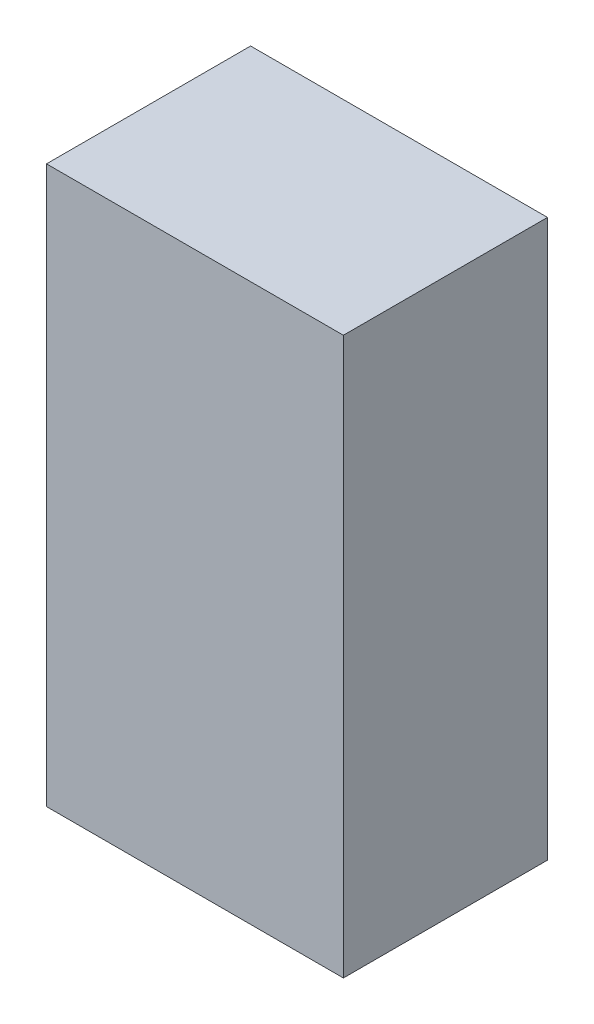
ISO-10303-21;
HEADER;
FILE_DESCRIPTION(('STEP AP214'),'2;1');
FILE_NAME('part.step','',(''),(''),'','','');
FILE_SCHEMA(('AUTOMOTIVE_DESIGN { 1 0 10303 214 1 1 1 1 }'));
ENDSEC;
DATA;
#1=APPLICATION_CONTEXT('core data for automotive mechanical design processes');
#2=APPLICATION_PROTOCOL_DEFINITION('international standard','automotive_design',2000,#1);
#3=PRODUCT_CONTEXT('',#1,'mechanical');
#4=PRODUCT('Part','Part','',(#3));
#5=PRODUCT_RELATED_PRODUCT_CATEGORY('part','',(#4));
#6=PRODUCT_DEFINITION_FORMATION('','',#4);
#7=PRODUCT_DEFINITION_CONTEXT('part definition',#1,'design');
#8=PRODUCT_DEFINITION('design','',#6,#7);
#9=PRODUCT_DEFINITION_SHAPE('','',#8);
#10=(LENGTH_UNIT() NAMED_UNIT(*) SI_UNIT(.MILLI.,.METRE.));
#11=(NAMED_UNIT(*) PLANE_ANGLE_UNIT() SI_UNIT($,.RADIAN.));
#12=(NAMED_UNIT(*) SI_UNIT($,.STERADIAN.) SOLID_ANGLE_UNIT());
#13=UNCERTAINTY_MEASURE_WITH_UNIT(LENGTH_MEASURE(1.E-05),#10,'distance_accuracy_value','');
#14=(GEOMETRIC_REPRESENTATION_CONTEXT(3) GLOBAL_UNCERTAINTY_ASSIGNED_CONTEXT((#13)) GLOBAL_UNIT_ASSIGNED_CONTEXT((#10,
#11,#12)) REPRESENTATION_CONTEXT('',''));
#15=CARTESIAN_POINT('',(0.,0.,0.));
#16=DIRECTION('',(0.,0.,1.));
#17=DIRECTION('',(1.,0.,0.));
#18=AXIS2_PLACEMENT_3D('',#15,#16,#17);
#19=CARTESIAN_POINT('',(-0.8000238,1.49999954,1.10000034));
#20=DIRECTION('',(0.,0.,-1.));
#21=DIRECTION('',(-1.,0.,0.));
#22=AXIS2_PLACEMENT_3D('',#19,#20,#21);
#23=PLANE('',#22);
#24=DIRECTION('',(-1.,0.,0.));
#25=VECTOR('',#24,1.);
#26=CARTESIAN_POINT('',(-0.8000238,-1.50000462,1.10000034));
#27=LINE('',#26,#25);
#28=CARTESIAN_POINT('',(-0.799980619999994,-1.50000462,1.10000034));
#29=VERTEX_POINT('',#28);
#30=CARTESIAN_POINT('',(0.80002126,-1.50000462,1.10000034));
#31=VERTEX_POINT('',#30);
#32=EDGE_CURVE('E58',#29,#31,#27,.F.);
#33=ORIENTED_EDGE('',*,*,#32,.T.);
#34=DIRECTION('',(1.69332668219827E-06,0.999999999998566,0.));
#35=VECTOR('',#34,1.);
#36=CARTESIAN_POINT('',(0.800026339982503,1.4999968305924,1.10000034));
#37=LINE('',#36,#35);
#38=CARTESIAN_POINT('',(0.800026339999994,1.50000716,1.10000034));
#39=VERTEX_POINT('',#38);
#40=EDGE_CURVE('E55',#31,#39,#37,.T.);
#41=ORIENTED_EDGE('',*,*,#40,.T.);
#42=DIRECTION('',(-0.99999999998866,-4.76235075414638E-06,0.));
#43=VECTOR('',#42,1.);
#44=CARTESIAN_POINT('',(-0.8000238,1.49999954000001,1.10000034));
#45=LINE('',#44,#43);
#46=CARTESIAN_POINT('',(-0.8000238,1.49999954,1.10000034));
#47=VERTEX_POINT('',#46);
#48=EDGE_CURVE('E19',#39,#47,#45,.T.);
#49=ORIENTED_EDGE('',*,*,#48,.T.);
#50=DIRECTION('',(-1.4393313375066E-05,0.999999999896416,0.));
#51=VECTOR('',#50,1.);
#52=CARTESIAN_POINT('',(-0.8000238,1.49999954,1.10000034));
#53=LINE('',#52,#51);
#54=EDGE_CURVE('E80',#47,#29,#53,.F.);
#55=ORIENTED_EDGE('',*,*,#54,.T.);
#56=EDGE_LOOP('',(#33,#41,#49,#55));
#57=FACE_BOUND('',#56,.T.);
#58=ADVANCED_FACE('F16',(#57),#23,.F.);
#59=CARTESIAN_POINT('',(0.80002634,1.50000716,0.));
#60=DIRECTION('',(4.76235075414638E-06,-0.99999999998866,0.));
#61=DIRECTION('',(0.99999999998866,4.76235075414638E-06,0.));
#62=AXIS2_PLACEMENT_3D('',#59,#60,#61);
#63=PLANE('',#62);
#64=DIRECTION('',(0.,0.,1.));
#65=VECTOR('',#64,1.);
#66=CARTESIAN_POINT('',(-0.8000238,1.49999954,0.));
#67=LINE('',#66,#65);
#68=CARTESIAN_POINT('',(-0.8000238,1.49999954,0.));
#69=VERTEX_POINT('',#68);
#70=EDGE_CURVE('E67',#69,#47,#67,.T.);
#71=ORIENTED_EDGE('',*,*,#70,.T.);
#72=ORIENTED_EDGE('',*,*,#48,.F.);
#73=DIRECTION('',(0.,0.,1.));
#74=VECTOR('',#73,1.);
#75=CARTESIAN_POINT('',(0.800026339999994,1.50000716,0.));
#76=LINE('',#75,#74);
#77=CARTESIAN_POINT('',(0.800026339999994,1.50000716,0.));
#78=VERTEX_POINT('',#77);
#79=EDGE_CURVE('E62',#39,#78,#76,.F.);
#80=ORIENTED_EDGE('',*,*,#79,.T.);
#81=DIRECTION('',(0.99999999998866,4.76235075414638E-06,0.));
#82=VECTOR('',#81,1.);
#83=CARTESIAN_POINT('',(0.80002634,1.50000716,0.));
#84=LINE('',#83,#82);
#85=EDGE_CURVE('E85',#69,#78,#84,.T.);
#86=ORIENTED_EDGE('',*,*,#85,.F.);
#87=EDGE_LOOP('',(#71,#72,#80,#86));
#88=FACE_BOUND('',#87,.T.);
#89=ADVANCED_FACE('F64',(#88),#63,.F.);
#90=CARTESIAN_POINT('',(0.80002126,-1.50000462,0.));
#91=DIRECTION('',(-0.999999999998566,1.69332668219827E-06,0.));
#92=DIRECTION('',(-1.69332668219827E-06,-0.999999999998566,0.));
#93=AXIS2_PLACEMENT_3D('',#90,#91,#92);
#94=PLANE('',#93);
#95=ORIENTED_EDGE('',*,*,#79,.F.);
#96=ORIENTED_EDGE('',*,*,#40,.F.);
#97=DIRECTION('',(0.,0.,1.));
#98=VECTOR('',#97,1.);
#99=CARTESIAN_POINT('',(0.80002126,-1.50000462,0.));
#100=LINE('',#99,#98);
#101=CARTESIAN_POINT('',(0.80002126,-1.50000462,0.));
#102=VERTEX_POINT('',#101);
#103=EDGE_CURVE('E74',#31,#102,#100,.F.);
#104=ORIENTED_EDGE('',*,*,#103,.T.);
#105=DIRECTION('',(-1.69332668219827E-06,-0.999999999998566,0.));
#106=VECTOR('',#105,1.);
#107=CARTESIAN_POINT('',(0.80002126,-1.50000462,0.));
#108=LINE('',#107,#106);
#109=EDGE_CURVE('E71',#78,#102,#108,.T.);
#110=ORIENTED_EDGE('',*,*,#109,.F.);
#111=EDGE_LOOP('',(#95,#96,#104,#110));
#112=FACE_BOUND('',#111,.T.);
#113=ADVANCED_FACE('F69',(#112),#94,.F.);
#114=CARTESIAN_POINT('',(-0.79998062,-1.50000462,0.));
#115=DIRECTION('',(0.,1.,0.));
#116=DIRECTION('',(0.,0.,1.));
#117=AXIS2_PLACEMENT_3D('',#114,#115,#116);
#118=PLANE('',#117);
#119=ORIENTED_EDGE('',*,*,#103,.F.);
#120=ORIENTED_EDGE('',*,*,#32,.F.);
#121=DIRECTION('',(0.,0.,1.));
#122=VECTOR('',#121,1.);
#123=CARTESIAN_POINT('',(-0.799980619999994,-1.50000462,0.));
#124=LINE('',#123,#122);
#125=CARTESIAN_POINT('',(-0.799980619999997,-1.50000462,0.));
#126=VERTEX_POINT('',#125);
#127=EDGE_CURVE('E34',#29,#126,#124,.F.);
#128=ORIENTED_EDGE('',*,*,#127,.T.);
#129=DIRECTION('',(-1.,0.,0.));
#130=VECTOR('',#129,1.);
#131=CARTESIAN_POINT('',(-0.8000238,-1.50000462,0.));
#132=LINE('',#131,#130);
#133=EDGE_CURVE('E25',#102,#126,#132,.T.);
#134=ORIENTED_EDGE('',*,*,#133,.F.);
#135=EDGE_LOOP('',(#119,#120,#128,#134));
#136=FACE_BOUND('',#135,.T.);
#137=ADVANCED_FACE('F90',(#136),#118,.F.);
#138=CARTESIAN_POINT('',(-0.8000238,1.49999954,0.));
#139=DIRECTION('',(0.999999999896416,1.4393313375066E-05,0.));
#140=DIRECTION('',(-1.4393313375066E-05,0.999999999896416,0.));
#141=AXIS2_PLACEMENT_3D('',#138,#139,#140);
#142=PLANE('',#141);
#143=ORIENTED_EDGE('',*,*,#127,.F.);
#144=ORIENTED_EDGE('',*,*,#54,.F.);
#145=ORIENTED_EDGE('',*,*,#70,.F.);
#146=DIRECTION('',(-1.43933133730643E-05,0.999999999896416,0.));
#147=VECTOR('',#146,1.);
#148=CARTESIAN_POINT('',(-0.79998062,-1.50000462,0.));
#149=LINE('',#148,#147);
#150=EDGE_CURVE('E11',#126,#69,#149,.T.);
#151=ORIENTED_EDGE('',*,*,#150,.F.);
#152=EDGE_LOOP('',(#143,#144,#145,#151));
#153=FACE_BOUND('',#152,.T.);
#154=ADVANCED_FACE('F89',(#153),#142,.F.);
#155=CARTESIAN_POINT('',(-0.8000238,1.49999954,0.));
#156=DIRECTION('',(0.,0.,-1.));
#157=DIRECTION('',(-1.,0.,0.));
#158=AXIS2_PLACEMENT_3D('',#155,#156,#157);
#159=PLANE('',#158);
#160=ORIENTED_EDGE('',*,*,#133,.T.);
#161=ORIENTED_EDGE('',*,*,#150,.T.);
#162=ORIENTED_EDGE('',*,*,#85,.T.);
#163=ORIENTED_EDGE('',*,*,#109,.T.);
#164=EDGE_LOOP('',(#160,#161,#162,#163));
#165=FACE_BOUND('',#164,.T.);
#166=ADVANCED_FACE('F87',(#165),#159,.T.);
#167=CLOSED_SHELL('',(#58,#89,#113,#137,#154,#166));
#168=MANIFOLD_SOLID_BREP('B1',#167);
#169=ADVANCED_BREP_SHAPE_REPRESENTATION('',(#18,#168),#14);
#170=SHAPE_DEFINITION_REPRESENTATION(#9,#169);
ENDSEC;
END-ISO-10303-21;
